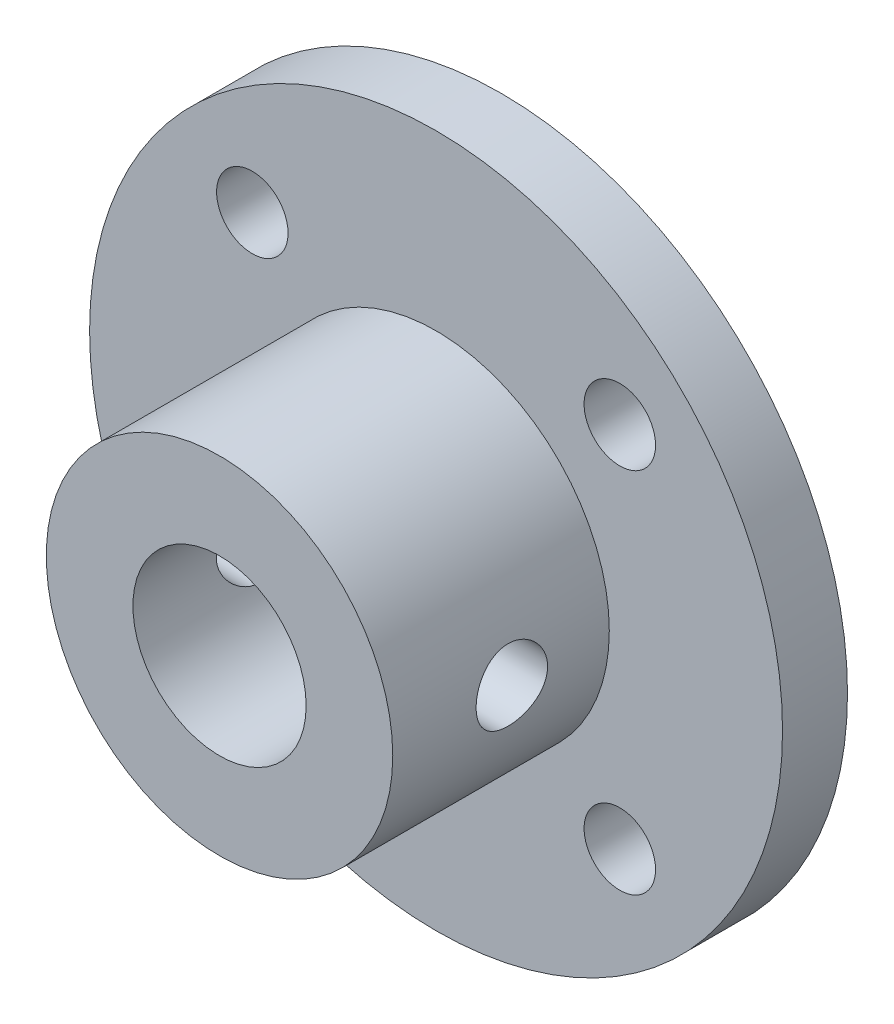
ISO-10303-21;
HEADER;
FILE_DESCRIPTION(('STEP AP214'),'2;1');
FILE_NAME('part.step','',(''),(''),'','','');
FILE_SCHEMA(('AUTOMOTIVE_DESIGN { 1 0 10303 214 1 1 1 1 }'));
ENDSEC;
DATA;
#1=APPLICATION_CONTEXT('core data for automotive mechanical design processes');
#2=APPLICATION_PROTOCOL_DEFINITION('international standard','automotive_design',2000,#1);
#3=PRODUCT_CONTEXT('',#1,'mechanical');
#4=PRODUCT('Part','Part','',(#3));
#5=PRODUCT_RELATED_PRODUCT_CATEGORY('part','',(#4));
#6=PRODUCT_DEFINITION_FORMATION('','',#4);
#7=PRODUCT_DEFINITION_CONTEXT('part definition',#1,'design');
#8=PRODUCT_DEFINITION('design','',#6,#7);
#9=PRODUCT_DEFINITION_SHAPE('','',#8);
#10=(LENGTH_UNIT() NAMED_UNIT(*) SI_UNIT(.MILLI.,.METRE.));
#11=(NAMED_UNIT(*) PLANE_ANGLE_UNIT() SI_UNIT($,.RADIAN.));
#12=(NAMED_UNIT(*) SI_UNIT($,.STERADIAN.) SOLID_ANGLE_UNIT());
#13=UNCERTAINTY_MEASURE_WITH_UNIT(LENGTH_MEASURE(1.E-05),#10,'distance_accuracy_value','');
#14=(GEOMETRIC_REPRESENTATION_CONTEXT(3) GLOBAL_UNCERTAINTY_ASSIGNED_CONTEXT((#13)) GLOBAL_UNIT_ASSIGNED_CONTEXT((#10,
#11,#12)) REPRESENTATION_CONTEXT('',''));
#15=CARTESIAN_POINT('',(0.,0.,0.));
#16=DIRECTION('',(0.,0.,1.));
#17=DIRECTION('',(1.,0.,0.));
#18=AXIS2_PLACEMENT_3D('',#15,#16,#17);
#19=CARTESIAN_POINT('',(0.,0.,3.));
#20=DIRECTION('',(0.,0.,-1.));
#21=DIRECTION('',(-1.,0.,0.));
#22=AXIS2_PLACEMENT_3D('',#19,#20,#21);
#23=CYLINDRICAL_SURFACE('',#22,16.);
#24=CARTESIAN_POINT('',(0.,0.,3.));
#25=DIRECTION('',(0.,0.,1.));
#26=DIRECTION('',(1.,0.,0.));
#27=AXIS2_PLACEMENT_3D('',#24,#25,#26);
#28=CIRCLE('',#27,16.);
#29=CARTESIAN_POINT('',(16.0000000000001,0.,3.));
#30=VERTEX_POINT('',#29);
#31=EDGE_CURVE('E47',#30,#30,#28,.T.);
#32=ORIENTED_EDGE('',*,*,#31,.F.);
#33=EDGE_LOOP('',(#32));
#34=FACE_BOUND('',#33,.T.);
#35=CARTESIAN_POINT('',(0.,0.,0.));
#36=DIRECTION('',(0.,0.,1.));
#37=DIRECTION('',(1.,0.,0.));
#38=AXIS2_PLACEMENT_3D('',#35,#36,#37);
#39=CIRCLE('',#38,16.);
#40=CARTESIAN_POINT('',(16.0000000000001,0.,0.));
#41=VERTEX_POINT('',#40);
#42=EDGE_CURVE('E55',#41,#41,#39,.T.);
#43=ORIENTED_EDGE('',*,*,#42,.T.);
#44=EDGE_LOOP('',(#43));
#45=FACE_BOUND('',#44,.T.);
#46=ADVANCED_FACE('F36',(#34,#45),#23,.T.);
#47=CARTESIAN_POINT('',(0.,0.,3.));
#48=DIRECTION('',(0.,0.,1.));
#49=DIRECTION('',(1.,0.,0.));
#50=AXIS2_PLACEMENT_3D('',#47,#48,#49);
#51=PLANE('',#50);
#52=CARTESIAN_POINT('',(-8.48528137423858,8.48528137423857,3.));
#53=DIRECTION('',(0.,0.,1.));
#54=DIRECTION('',(1.,0.,0.));
#55=AXIS2_PLACEMENT_3D('',#52,#53,#54);
#56=CIRCLE('',#55,1.65);
#57=CARTESIAN_POINT('',(-6.83528137423857,8.48528137423857,3.));
#58=VERTEX_POINT('',#57);
#59=EDGE_CURVE('E193',#58,#58,#56,.T.);
#60=ORIENTED_EDGE('',*,*,#59,.F.);
#61=EDGE_LOOP('',(#60));
#62=FACE_BOUND('',#61,.T.);
#63=CARTESIAN_POINT('',(8.48528137423857,8.48528137423857,3.));
#64=DIRECTION('',(0.,0.,1.));
#65=DIRECTION('',(1.,0.,0.));
#66=AXIS2_PLACEMENT_3D('',#63,#64,#65);
#67=CIRCLE('',#66,1.65);
#68=CARTESIAN_POINT('',(10.1352813742386,8.48528137423857,3.));
#69=VERTEX_POINT('',#68);
#70=EDGE_CURVE('E189',#69,#69,#67,.T.);
#71=ORIENTED_EDGE('',*,*,#70,.F.);
#72=EDGE_LOOP('',(#71));
#73=FACE_BOUND('',#72,.T.);
#74=CARTESIAN_POINT('',(8.4852813742386,-8.48528137423861,3.));
#75=DIRECTION('',(0.,0.,1.));
#76=DIRECTION('',(1.,0.,0.));
#77=AXIS2_PLACEMENT_3D('',#74,#75,#76);
#78=CIRCLE('',#77,1.65);
#79=CARTESIAN_POINT('',(10.1352813742386,-8.48528137423861,3.));
#80=VERTEX_POINT('',#79);
#81=EDGE_CURVE('E183',#80,#80,#78,.T.);
#82=ORIENTED_EDGE('',*,*,#81,.F.);
#83=EDGE_LOOP('',(#82));
#84=FACE_BOUND('',#83,.T.);
#85=CARTESIAN_POINT('',(-8.48528137423861,-8.4852813742386,3.));
#86=DIRECTION('',(0.,0.,1.));
#87=DIRECTION('',(1.,0.,0.));
#88=AXIS2_PLACEMENT_3D('',#85,#86,#87);
#89=CIRCLE('',#88,1.65);
#90=CARTESIAN_POINT('',(-6.83528137423861,-8.4852813742386,3.));
#91=VERTEX_POINT('',#90);
#92=EDGE_CURVE('E177',#91,#91,#89,.T.);
#93=ORIENTED_EDGE('',*,*,#92,.F.);
#94=EDGE_LOOP('',(#93));
#95=FACE_BOUND('',#94,.T.);
#96=CARTESIAN_POINT('',(0.,0.,3.));
#97=DIRECTION('',(0.,0.,1.));
#98=DIRECTION('',(1.,0.,0.));
#99=AXIS2_PLACEMENT_3D('',#96,#97,#98);
#100=CIRCLE('',#99,8.);
#101=CARTESIAN_POINT('',(8.00000000000002,0.,3.));
#102=VERTEX_POINT('',#101);
#103=EDGE_CURVE('E66',#102,#102,#100,.T.);
#104=ORIENTED_EDGE('',*,*,#103,.F.);
#105=EDGE_LOOP('',(#104));
#106=FACE_BOUND('',#105,.T.);
#107=ORIENTED_EDGE('',*,*,#31,.T.);
#108=EDGE_LOOP('',(#107));
#109=FACE_BOUND('',#108,.T.);
#110=ADVANCED_FACE('F116',(#62,#73,#84,#95,#106,#109),#51,.T.);
#111=CARTESIAN_POINT('',(0.,0.,0.));
#112=DIRECTION('',(0.,0.,1.));
#113=DIRECTION('',(1.,0.,0.));
#114=AXIS2_PLACEMENT_3D('',#111,#112,#113);
#115=PLANE('',#114);
#116=CARTESIAN_POINT('',(-8.48528137423859,8.48528137423857,0.));
#117=DIRECTION('',(0.,0.,1.));
#118=DIRECTION('',(1.,0.,0.));
#119=AXIS2_PLACEMENT_3D('',#116,#117,#118);
#120=CIRCLE('',#119,1.65);
#121=CARTESIAN_POINT('',(-6.83528137423859,8.48528137423857,0.));
#122=VERTEX_POINT('',#121);
#123=EDGE_CURVE('E132',#122,#122,#120,.T.);
#124=ORIENTED_EDGE('',*,*,#123,.T.);
#125=EDGE_LOOP('',(#124));
#126=FACE_BOUND('',#125,.T.);
#127=CARTESIAN_POINT('',(8.48528137423857,8.48528137423857,0.));
#128=DIRECTION('',(0.,0.,1.));
#129=DIRECTION('',(1.,0.,0.));
#130=AXIS2_PLACEMENT_3D('',#127,#128,#129);
#131=CIRCLE('',#130,1.65);
#132=CARTESIAN_POINT('',(10.1352813742386,8.48528137423857,0.));
#133=VERTEX_POINT('',#132);
#134=EDGE_CURVE('E136',#133,#133,#131,.T.);
#135=ORIENTED_EDGE('',*,*,#134,.T.);
#136=EDGE_LOOP('',(#135));
#137=FACE_BOUND('',#136,.T.);
#138=CARTESIAN_POINT('',(8.48528137423857,-8.48528137423857,0.));
#139=DIRECTION('',(0.,0.,1.));
#140=DIRECTION('',(1.,0.,0.));
#141=AXIS2_PLACEMENT_3D('',#138,#139,#140);
#142=CIRCLE('',#141,1.65);
#143=CARTESIAN_POINT('',(10.1352813742386,-8.48528137423857,0.));
#144=VERTEX_POINT('',#143);
#145=EDGE_CURVE('E140',#144,#144,#142,.T.);
#146=ORIENTED_EDGE('',*,*,#145,.T.);
#147=EDGE_LOOP('',(#146));
#148=FACE_BOUND('',#147,.T.);
#149=CARTESIAN_POINT('',(-8.48528137423861,-8.4852813742386,0.));
#150=DIRECTION('',(0.,0.,1.));
#151=DIRECTION('',(1.,0.,0.));
#152=AXIS2_PLACEMENT_3D('',#149,#150,#151);
#153=CIRCLE('',#152,1.65);
#154=CARTESIAN_POINT('',(-6.83528137423861,-8.4852813742386,0.));
#155=VERTEX_POINT('',#154);
#156=EDGE_CURVE('E144',#155,#155,#153,.T.);
#157=ORIENTED_EDGE('',*,*,#156,.T.);
#158=EDGE_LOOP('',(#157));
#159=FACE_BOUND('',#158,.T.);
#160=CARTESIAN_POINT('',(0.,0.,0.));
#161=DIRECTION('',(0.,0.,1.));
#162=DIRECTION('',(1.,0.,0.));
#163=AXIS2_PLACEMENT_3D('',#160,#161,#162);
#164=CIRCLE('',#163,4.);
#165=CARTESIAN_POINT('',(4.00000000000002,0.,0.));
#166=VERTEX_POINT('',#165);
#167=EDGE_CURVE('E147',#166,#166,#164,.T.);
#168=ORIENTED_EDGE('',*,*,#167,.T.);
#169=EDGE_LOOP('',(#168));
#170=FACE_BOUND('',#169,.T.);
#171=ORIENTED_EDGE('',*,*,#42,.F.);
#172=EDGE_LOOP('',(#171));
#173=FACE_BOUND('',#172,.T.);
#174=ADVANCED_FACE('F112',(#126,#137,#148,#159,#170,#173),#115,.F.);
#175=CARTESIAN_POINT('',(0.,0.,13.));
#176=DIRECTION('',(0.,0.,-1.));
#177=DIRECTION('',(-1.,0.,0.));
#178=AXIS2_PLACEMENT_3D('',#175,#176,#177);
#179=CYLINDRICAL_SURFACE('',#178,8.);
#180=CARTESIAN_POINT('',(8.00000000000001,0.,5.84999999999999));
#181=CARTESIAN_POINT('',(7.99999830466002,-0.0916407195421168,5.8500032970978));
#182=CARTESIAN_POINT('',(7.99840926134725,-0.183322508381988,5.85766035518842));
#183=CARTESIAN_POINT('',(7.99222359173557,-0.364090486799893,5.88805953567183));
#184=CARTESIAN_POINT('',(7.98762465402597,-0.453174626583013,5.91081325153871));
#185=CARTESIAN_POINT('',(7.97593225373361,-0.62610793776139,5.97066960772639));
#186=CARTESIAN_POINT('',(7.9688412517652,-0.709962177239571,6.00775809776895));
#187=CARTESIAN_POINT('',(7.95293377965833,-0.870252949930924,6.09518820033904));
#188=CARTESIAN_POINT('',(7.94411739325117,-0.946689842831834,6.14552916977705));
#189=CARTESIAN_POINT('',(7.9255864867241,-1.0910785006724,6.2588010629735));
#190=CARTESIAN_POINT('',(7.91586187136436,-1.15890845453259,6.32188562354079));
#191=CARTESIAN_POINT('',(7.89668321805648,-1.28310256116973,6.45852382878229));
#192=CARTESIAN_POINT('',(7.88722920223018,-1.3394657788141,6.53207832646761));
#193=CARTESIAN_POINT('',(7.86956329469159,-1.43965110093205,6.68845261124893));
#194=CARTESIAN_POINT('',(7.86136437560846,-1.48334592346544,6.77135554051843));
#195=CARTESIAN_POINT('',(7.84728086241898,-1.556138374432,6.94352376346135));
#196=CARTESIAN_POINT('',(7.84139602426695,-1.58523754222915,7.0327883850498));
#197=CARTESIAN_POINT('',(7.83270934672409,-1.6276148943817,7.21383194999833));
#198=CARTESIAN_POINT('',(7.82986577646946,-1.64110744112713,7.30555867318196));
#199=CARTESIAN_POINT('',(7.82745807970268,-1.65255460798122,7.49001455100844));
#200=CARTESIAN_POINT('',(7.82789359605782,-1.65051092017599,7.58274359538778));
#201=CARTESIAN_POINT('',(7.83195699249662,-1.63111668222383,7.76499542508165));
#202=CARTESIAN_POINT('',(7.8355333998161,-1.61401292403973,7.85454579230343));
#203=CARTESIAN_POINT('',(7.84539445259545,-1.56537407698978,8.02947813147744));
#204=CARTESIAN_POINT('',(7.85167923477146,-1.53383825960256,8.1148598927602));
#205=CARTESIAN_POINT('',(7.86630090751808,-1.4569977791722,8.27973690269176));
#206=CARTESIAN_POINT('',(7.8746521540866,-1.41159624906004,8.35918568076119));
#207=CARTESIAN_POINT('',(7.89245670014424,-1.3083813944234,8.50942921254005));
#208=CARTESIAN_POINT('',(7.90191013391075,-1.25056655688558,8.58022290966054));
#209=CARTESIAN_POINT('',(7.92107619190931,-1.12284972991962,8.71256973923748));
#210=CARTESIAN_POINT('',(7.93079031160688,-1.05273735419365,8.77391980874557));
#211=CARTESIAN_POINT('',(7.94921762583845,-0.903112309957831,8.88402151702536));
#212=CARTESIAN_POINT('',(7.95793080592347,-0.823599505782695,8.93277297394378));
#213=CARTESIAN_POINT('',(7.97339804723507,-0.657197902062817,9.01633520611295));
#214=CARTESIAN_POINT('',(7.98014868624195,-0.570296555511034,9.0511216693748));
#215=CARTESIAN_POINT('',(7.99090445204566,-0.391712622109074,9.10554403083056));
#216=CARTESIAN_POINT('',(7.99490993294788,-0.300030653566686,9.1251818831259));
#217=CARTESIAN_POINT('',(7.99967440549744,-0.116231946363161,9.14845954083965));
#218=CARTESIAN_POINT('',(8.00048974989201,-0.0241517979908812,9.15237707288142));
#219=CARTESIAN_POINT('',(7.998939058222,0.159347264679047,9.14485239834092));
#220=CARTESIAN_POINT('',(7.9965732128957,0.250766218290311,9.13341111264522));
#221=CARTESIAN_POINT('',(7.98896133117212,0.429444014904549,9.09572418712624));
#222=CARTESIAN_POINT('',(7.98374323165774,0.51673442647503,9.06962207793273));
#223=CARTESIAN_POINT('',(7.97101009225547,0.685699095825317,9.00351209172612));
#224=CARTESIAN_POINT('',(7.96349487230839,0.767372912734796,8.96350312459376));
#225=CARTESIAN_POINT('',(7.9468611414208,0.923949860452786,8.87012152443845));
#226=CARTESIAN_POINT('',(7.93772318016807,0.998751941729388,8.81658299644502));
#227=CARTESIAN_POINT('',(7.91890127310844,1.13840995014641,8.69788296043952));
#228=CARTESIAN_POINT('',(7.90921726486106,1.20326473664665,8.63272012133688));
#229=CARTESIAN_POINT('',(7.89020322125626,1.32226758953253,8.49135347486469));
#230=CARTESIAN_POINT('',(7.88088150077534,1.37622443804948,8.41498738366169));
#231=CARTESIAN_POINT('',(7.86382860657073,1.47054630126095,8.25411308003519));
#232=CARTESIAN_POINT('',(7.85609736723785,1.51091187665496,8.16960520368099));
#233=CARTESIAN_POINT('',(7.84316897738332,1.57664965148856,7.99528280762368));
#234=CARTESIAN_POINT('',(7.83795830360763,1.60210202195347,7.90549957210851));
#235=CARTESIAN_POINT('',(7.83063366117501,1.63753157889184,7.7228109665724));
#236=CARTESIAN_POINT('',(7.82851925954994,1.64751092905123,7.62990603493373));
#237=CARTESIAN_POINT('',(7.82765166523676,1.65162714556421,7.44553365991831));
#238=CARTESIAN_POINT('',(7.82883429816181,1.64606648188569,7.35407313863651));
#239=CARTESIAN_POINT('',(7.83428356728564,1.61993087801278,7.17342157552559));
#240=CARTESIAN_POINT('',(7.83855017513696,1.59935607582618,7.08423051284372));
#241=CARTESIAN_POINT('',(7.84965710898139,1.54391487276413,6.91085765152253));
#242=CARTESIAN_POINT('',(7.8564903451322,1.50908781763049,6.82666278697623));
#243=CARTESIAN_POINT('',(7.87196421207745,1.42616638770603,6.66526468478995));
#244=CARTESIAN_POINT('',(7.88060500656398,1.37807081119502,6.58806208127553));
#245=CARTESIAN_POINT('',(7.89891524219783,1.26895419649462,6.44133870150522));
#246=CARTESIAN_POINT('',(7.90860042776132,1.20771563989232,6.3719816260356));
#247=CARTESIAN_POINT('',(7.92779756602148,1.07449788612564,6.2444283458795));
#248=CARTESIAN_POINT('',(7.93730947834751,1.00251622096491,6.18623471279067));
#249=CARTESIAN_POINT('',(7.95521487654738,0.848880613767823,6.08203856905748));
#250=CARTESIAN_POINT('',(7.96359456503878,0.76712690091551,6.03618068748805));
#251=CARTESIAN_POINT('',(7.97815479541984,0.596921258332706,5.95892786004796));
#252=CARTESIAN_POINT('',(7.98433727409232,0.508475311474889,5.92752016948176));
#253=CARTESIAN_POINT('',(7.99263694073892,0.349887562280618,5.88598583861668));
#254=CARTESIAN_POINT('',(7.99538162684993,0.280634724618699,5.87251574674512));
#255=CARTESIAN_POINT('',(7.99906377620171,0.140929326188167,5.85452171892962));
#256=CARTESIAN_POINT('',(8.00000130381072,0.0704768082405113,5.84999746434847));
#257=CARTESIAN_POINT('',(8.00000000000001,0.,5.84999999999999));
#258=B_SPLINE_CURVE_WITH_KNOTS('',3,(#180,#181,#182,#183,#184,#185,#186,#187,#188,#189,#190,
#191,#192,#193,#194,#195,#196,#197,#198,#199,#200,#201,#202,#203,#204,#205,#206,#207,#208,#209,
#210,#211,#212,#213,#214,#215,#216,#217,#218,#219,#220,#221,#222,#223,#224,#225,#226,#227,#228,
#229,#230,#231,#232,#233,#234,#235,#236,#237,#238,#239,#240,#241,#242,#243,#244,#245,#246,#247,
#248,#249,#250,#251,#252,#253,#254,#255,#256,#257),.UNSPECIFIED.,.T.,.F.,(4,2,2,2,2,2,2,2,2,2,2,
2,2,2,2,2,2,2,2,2,2,2,2,2,2,2,2,2,2,2,2,2,2,2,2,2,2,2,4),(0.,0.274664286133516,
0.549539745146944,0.824144556648062,1.09873604513762,1.37686012616534,1.65500687961845,
1.93585838646541,2.2166802664369,2.4935973572463,2.77048428882735,3.04291655166272,
3.3153625682266,3.58975722869537,3.86418535314678,4.14387209364694,4.4235628710289,
4.70373847885488,4.98387793926427,5.25904586820427,5.53419729931632,5.80670078626848,
6.07922563881696,6.35526963287403,6.63134525682187,6.9119094352296,7.19246203771849,
7.4714922579036,7.75048345608685,8.02408241270294,8.2976788544684,8.57052502859192,
8.8433959223092,9.12118929442815,9.39904658206407,9.68003210657603,9.9607693317831,
10.1720089623927,10.3832410688303),.UNSPECIFIED.);
#259=CARTESIAN_POINT('',(8.00000000000001,0.,5.84999999999999));
#260=VERTEX_POINT('',#259);
#261=EDGE_CURVE('E10',#260,#260,#258,.T.);
#262=ORIENTED_EDGE('',*,*,#261,.T.);
#263=EDGE_LOOP('',(#262));
#264=FACE_BOUND('',#263,.T.);
#265=CARTESIAN_POINT('',(-8.,0.,9.14999999999999));
#266=CARTESIAN_POINT('',(-7.99999830466001,-0.0916407195421156,9.14999670290219));
#267=CARTESIAN_POINT('',(-7.99840926134724,-0.183322508381984,9.14233964481154));
#268=CARTESIAN_POINT('',(-7.99222359173558,-0.364090486799893,9.11194046432812));
#269=CARTESIAN_POINT('',(-7.987624654026,-0.45317462658302,9.08918674846127));
#270=CARTESIAN_POINT('',(-7.97593225373365,-0.62610793776139,9.02933039227361));
#271=CARTESIAN_POINT('',(-7.96884125176521,-0.709962177239556,8.99224190223103));
#272=CARTESIAN_POINT('',(-7.95293377965833,-0.870252949930892,8.90481179966093));
#273=CARTESIAN_POINT('',(-7.94411739325118,-0.946689842831799,8.85447083022293));
#274=CARTESIAN_POINT('',(-7.92558648672412,-1.09107850067236,8.74119893702649));
#275=CARTESIAN_POINT('',(-7.91586187136437,-1.15890845453256,8.6781143764592));
#276=CARTESIAN_POINT('',(-7.89668321805648,-1.2831025611697,8.5414761712177));
#277=CARTESIAN_POINT('',(-7.88722920223019,-1.33946577881408,8.46792167353237));
#278=CARTESIAN_POINT('',(-7.86956329469159,-1.43965110093203,8.31154738875106));
#279=CARTESIAN_POINT('',(-7.86136437560846,-1.48334592346542,8.22864445948156));
#280=CARTESIAN_POINT('',(-7.84728086241899,-1.55613837443199,8.05647623653866));
#281=CARTESIAN_POINT('',(-7.84139602426697,-1.58523754222915,7.96721161495021));
#282=CARTESIAN_POINT('',(-7.83270934672411,-1.62761489438171,7.78616805000169));
#283=CARTESIAN_POINT('',(-7.82986577646946,-1.64110744112713,7.69444132681805));
#284=CARTESIAN_POINT('',(-7.82745807970267,-1.65255460798121,7.50998544899157));
#285=CARTESIAN_POINT('',(-7.82789359605782,-1.65051092017597,7.41725640461224));
#286=CARTESIAN_POINT('',(-7.83195699249662,-1.63111668222382,7.23500457491836));
#287=CARTESIAN_POINT('',(-7.83553339981609,-1.61401292403973,7.14545420769657));
#288=CARTESIAN_POINT('',(-7.84539445259546,-1.5653740769898,6.97052186852255));
#289=CARTESIAN_POINT('',(-7.8516792347715,-1.53383825960257,6.88514010723978));
#290=CARTESIAN_POINT('',(-7.86630090751812,-1.4569977791722,6.72026309730822));
#291=CARTESIAN_POINT('',(-7.8746521540866,-1.41159624906005,6.64081431923879));
#292=CARTESIAN_POINT('',(-7.89245670014424,-1.30838139442342,6.49057078745993));
#293=CARTESIAN_POINT('',(-7.90191013391078,-1.25056655688559,6.41977709033945));
#294=CARTESIAN_POINT('',(-7.92107619190935,-1.12284972991964,6.28743026076251));
#295=CARTESIAN_POINT('',(-7.93079031160689,-1.05273735419366,6.22608019125439));
#296=CARTESIAN_POINT('',(-7.94921762583844,-0.90311230995784,6.11597848297461));
#297=CARTESIAN_POINT('',(-7.95793080592347,-0.823599505782693,6.06722702605621));
#298=CARTESIAN_POINT('',(-7.97339804723507,-0.657197902062814,5.98366479388703));
#299=CARTESIAN_POINT('',(-7.98014868624195,-0.570296555511042,5.94887833062515));
#300=CARTESIAN_POINT('',(-7.99090445204566,-0.391712622109082,5.89445596916941));
#301=CARTESIAN_POINT('',(-7.99490993294788,-0.300030653566683,5.87481811687412));
#302=CARTESIAN_POINT('',(-7.99967440549745,-0.116231946363141,5.85154045916035));
#303=CARTESIAN_POINT('',(-8.00048974989201,-0.0241517979908554,5.84762292711853));
#304=CARTESIAN_POINT('',(-7.998939058222,0.159347264679063,5.85514760165904));
#305=CARTESIAN_POINT('',(-7.99657321289572,0.250766218290311,5.86658888735481));
#306=CARTESIAN_POINT('',(-7.98896133117214,0.429444014904586,5.90427581287376));
#307=CARTESIAN_POINT('',(-7.98374323165773,0.516734426475119,5.93037792206718));
#308=CARTESIAN_POINT('',(-7.97101009225547,0.685699095825369,5.99648790827394));
#309=CARTESIAN_POINT('',(-7.9634948723084,0.76737291273476,6.03649687540653));
#310=CARTESIAN_POINT('',(-7.9468611414208,0.923949860452769,6.12987847556187));
#311=CARTESIAN_POINT('',(-7.93772318016806,0.998751941729485,6.18341700355509));
#312=CARTESIAN_POINT('',(-7.91890127310843,1.13840995014653,6.30211703956046));
#313=CARTESIAN_POINT('',(-7.90921726486108,1.20326473664668,6.36727987866316));
#314=CARTESIAN_POINT('',(-7.89020322125628,1.32226758953251,6.50864652513537));
#315=CARTESIAN_POINT('',(-7.88088150077533,1.37622443804951,6.58501261633832));
#316=CARTESIAN_POINT('',(-7.86382860657073,1.47054630126098,6.74588691996481));
#317=CARTESIAN_POINT('',(-7.85609736723788,1.51091187665495,6.83039479631904));
#318=CARTESIAN_POINT('',(-7.84316897738335,1.57664965148855,7.00471719237641));
#319=CARTESIAN_POINT('',(-7.83795830360762,1.6021020219535,7.0945004278916));
#320=CARTESIAN_POINT('',(-7.830633661175,1.63753157889189,7.2771890334278));
#321=CARTESIAN_POINT('',(-7.82851925954997,1.64751092905125,7.37009396506652));
#322=CARTESIAN_POINT('',(-7.8276516652368,1.65162714556417,7.55446634008198));
#323=CARTESIAN_POINT('',(-7.82883429816182,1.64606648188562,7.64592686136377));
#324=CARTESIAN_POINT('',(-7.83428356728564,1.61993087801275,7.8265784244747));
#325=CARTESIAN_POINT('',(-7.83855017513697,1.59935607582623,7.91576948715659));
#326=CARTESIAN_POINT('',(-7.84965710898141,1.54391487276412,8.08914234847774));
#327=CARTESIAN_POINT('',(-7.85649034513222,1.50908781763035,8.17333721302397));
#328=CARTESIAN_POINT('',(-7.87196421207748,1.4261663877059,8.33473531521029));
#329=CARTESIAN_POINT('',(-7.88060500656403,1.37807081119504,8.41193791872481));
#330=CARTESIAN_POINT('',(-7.89891524219788,1.26895419649462,8.55866129849506));
#331=CARTESIAN_POINT('',(-7.90860042776135,1.20771563989214,8.62801837396452));
#332=CARTESIAN_POINT('',(-7.92779756602151,1.07449788612546,8.75557165412064));
#333=CARTESIAN_POINT('',(-7.93730947834756,1.00251622096491,8.81376528720966));
#334=CARTESIAN_POINT('',(-7.95521487654741,0.848880613767887,8.91796143094282));
#335=CARTESIAN_POINT('',(-7.96359456503879,0.767126900915464,8.96381931251201));
#336=CARTESIAN_POINT('',(-7.97815479541985,0.596921258332613,9.04107213995195));
#337=CARTESIAN_POINT('',(-7.98433727409236,0.508475311474859,9.07247983051822));
#338=CARTESIAN_POINT('',(-7.99263694073895,0.349887562280625,9.11401416138331));
#339=CARTESIAN_POINT('',(-7.99538162684994,0.280634724618693,9.12748425325484));
#340=CARTESIAN_POINT('',(-7.99906377620171,0.140929326188154,9.14547828107034));
#341=CARTESIAN_POINT('',(-8.00000130381071,0.0704768082405035,9.15000253565151));
#342=CARTESIAN_POINT('',(-8.,0.,9.14999999999999));
#343=B_SPLINE_CURVE_WITH_KNOTS('',3,(#265,#266,#267,#268,#269,#270,#271,#272,#273,#274,#275,
#276,#277,#278,#279,#280,#281,#282,#283,#284,#285,#286,#287,#288,#289,#290,#291,#292,#293,#294,
#295,#296,#297,#298,#299,#300,#301,#302,#303,#304,#305,#306,#307,#308,#309,#310,#311,#312,#313,
#314,#315,#316,#317,#318,#319,#320,#321,#322,#323,#324,#325,#326,#327,#328,#329,#330,#331,#332,
#333,#334,#335,#336,#337,#338,#339,#340,#341,#342),.UNSPECIFIED.,.T.,.F.,(4,2,2,2,2,2,2,2,2,2,2,
2,2,2,2,2,2,2,2,2,2,2,2,2,2,2,2,2,2,2,2,2,2,2,2,2,2,2,4),(0.,0.274664286133511,
0.549539745146941,0.82414455664804,1.09873604513758,1.3768601261653,1.65500687961842,
1.93585838646537,2.21668026643685,2.49359735724625,2.7704842888273,3.04291655166269,
3.31536256822657,3.58975722869534,3.86418535314676,4.14387209364692,4.42356287102889,
4.70373847885486,4.98387793926426,5.25904586820428,5.53419729931633,5.80670078626852,
6.07922563881709,6.35526963287411,6.63134525682186,6.91190943522957,7.19246203771847,
7.47149225790371,7.75048345608709,8.02408241270318,8.29767885446863,8.57052502859214,
8.84339592230943,9.12118929442836,9.39904658206424,9.68003210657612,9.96076933178312,
10.1720089623927,10.3832410688303),.UNSPECIFIED.);
#344=CARTESIAN_POINT('',(-8.,0.,9.14999999999999));
#345=VERTEX_POINT('',#344);
#346=EDGE_CURVE('E68',#345,#345,#343,.T.);
#347=ORIENTED_EDGE('',*,*,#346,.T.);
#348=EDGE_LOOP('',(#347));
#349=FACE_BOUND('',#348,.T.);
#350=CARTESIAN_POINT('',(0.,0.,13.));
#351=DIRECTION('',(0.,0.,1.));
#352=DIRECTION('',(1.,0.,0.));
#353=AXIS2_PLACEMENT_3D('',#350,#351,#352);
#354=CIRCLE('',#353,8.);
#355=CARTESIAN_POINT('',(8.00000000000003,0.,13.));
#356=VERTEX_POINT('',#355);
#357=EDGE_CURVE('E63',#356,#356,#354,.T.);
#358=ORIENTED_EDGE('',*,*,#357,.F.);
#359=EDGE_LOOP('',(#358));
#360=FACE_BOUND('',#359,.T.);
#361=ORIENTED_EDGE('',*,*,#103,.T.);
#362=EDGE_LOOP('',(#361));
#363=FACE_BOUND('',#362,.T.);
#364=ADVANCED_FACE('F73',(#264,#349,#360,#363),#179,.T.);
#365=CARTESIAN_POINT('',(0.,0.,13.));
#366=DIRECTION('',(0.,0.,1.));
#367=DIRECTION('',(1.,0.,0.));
#368=AXIS2_PLACEMENT_3D('',#365,#366,#367);
#369=PLANE('',#368);
#370=CARTESIAN_POINT('',(0.,0.,13.));
#371=DIRECTION('',(0.,0.,1.));
#372=DIRECTION('',(1.,0.,0.));
#373=AXIS2_PLACEMENT_3D('',#370,#371,#372);
#374=CIRCLE('',#373,4.);
#375=CARTESIAN_POINT('',(4.00000000000002,0.,13.));
#376=VERTEX_POINT('',#375);
#377=EDGE_CURVE('E150',#376,#376,#374,.T.);
#378=ORIENTED_EDGE('',*,*,#377,.F.);
#379=EDGE_LOOP('',(#378));
#380=FACE_BOUND('',#379,.T.);
#381=ORIENTED_EDGE('',*,*,#357,.T.);
#382=EDGE_LOOP('',(#381));
#383=FACE_BOUND('',#382,.T.);
#384=ADVANCED_FACE('F103',(#380,#383),#369,.T.);
#385=CARTESIAN_POINT('',(0.,0.,0.));
#386=DIRECTION('',(0.,0.,1.));
#387=DIRECTION('',(1.,0.,0.));
#388=AXIS2_PLACEMENT_3D('',#385,#386,#387);
#389=CYLINDRICAL_SURFACE('',#388,4.);
#390=CARTESIAN_POINT('',(4.,0.,5.84999999999999));
#391=CARTESIAN_POINT('',(3.99999309817076,0.0884596783632776,5.85000921720662));
#392=CARTESIAN_POINT('',(3.99703145792173,0.177062252057582,5.8571560143433));
#393=CARTESIAN_POINT('',(3.9854711320255,0.351759669836408,5.88549114193689));
#394=CARTESIAN_POINT('',(3.97685757767606,0.437847271996959,5.90671651102431));
#395=CARTESIAN_POINT('',(3.95491965529936,0.604702496902741,5.96229481220189));
#396=CARTESIAN_POINT('',(3.94161112398211,0.685486934491198,5.99660364335344));
#397=CARTESIAN_POINT('',(3.91158286286531,0.840076633223484,6.07719475784942));
#398=CARTESIAN_POINT('',(3.89486420463245,0.913884076117555,6.12347328117016));
#399=CARTESIAN_POINT('',(3.85876900012149,1.05618769598524,6.22910675464405));
#400=CARTESIAN_POINT('',(3.83930654387258,1.12429373957476,6.28895767024897));
#401=CARTESIAN_POINT('',(3.80029483347099,1.24983574384757,6.41898883965896));
#402=CARTESIAN_POINT('',(3.78074553976623,1.30726618926956,6.48917439921181));
#403=CARTESIAN_POINT('',(3.74272551686067,1.41254826809048,6.64196824887172));
#404=CARTESIAN_POINT('',(3.72435159658093,1.4598078179056,6.72501111530653));
#405=CARTESIAN_POINT('',(3.69212136090386,1.53951358199406,6.89873630929018));
#406=CARTESIAN_POINT('',(3.67826276509115,1.57196727712791,6.98941475136301));
#407=CARTESIAN_POINT('',(3.65756021871623,1.61953738222491,7.17134799700183));
#408=CARTESIAN_POINT('',(3.65041449103237,1.63540371417152,7.26237107214306));
#409=CARTESIAN_POINT('',(3.64307714795704,1.65168918120801,7.44604650736527));
#410=CARTESIAN_POINT('',(3.64288180572738,1.65211659474,7.53869796762929));
#411=CARTESIAN_POINT('',(3.64921138579605,1.6380778077983,7.71559888661871));
#412=CARTESIAN_POINT('',(3.65523439741041,1.62472398487457,7.79995815874914));
#413=CARTESIAN_POINT('',(3.67247532251838,1.58536484231196,7.96511028438116));
#414=CARTESIAN_POINT('',(3.68369420783859,1.55935715587184,8.04590246760329));
#415=CARTESIAN_POINT('',(3.71031458481431,1.49492412942488,8.20364510875861));
#416=CARTESIAN_POINT('',(3.72579923184192,1.45624866973015,8.28047873780831));
#417=CARTESIAN_POINT('',(3.75918616236908,1.36775445443623,8.42686023246002));
#418=CARTESIAN_POINT('',(3.77708938726886,1.31793135478159,8.49640524224914));
#419=CARTESIAN_POINT('',(3.81509742396095,1.20371911924869,8.6322864077878));
#420=CARTESIAN_POINT('',(3.8352618825369,1.13846630094387,8.69788195770323));
#421=CARTESIAN_POINT('',(3.87426910607353,0.9976825548662,8.81744467444136));
#422=CARTESIAN_POINT('',(3.8931115728953,0.922149319847429,8.87140922386083));
#423=CARTESIAN_POINT('',(3.92787932271737,0.760736369737323,8.96723477358503));
#424=CARTESIAN_POINT('',(3.94373050716791,0.674664094072226,9.00880028319415));
#425=CARTESIAN_POINT('',(3.97016319816606,0.495928253552966,9.07660302410885));
#426=CARTESIAN_POINT('',(3.98074755693754,0.403268287372383,9.10284855321117));
#427=CARTESIAN_POINT('',(3.99492450637935,0.220181304317677,9.13772950367822));
#428=CARTESIAN_POINT('',(3.99891121146315,0.129974172308223,9.14735917793591));
#429=CARTESIAN_POINT('',(4.00069746426785,-0.0508474401522222,9.15169204376327));
#430=CARTESIAN_POINT('',(3.99849874371344,-0.141461799500566,9.1463994131082));
#431=CARTESIAN_POINT('',(3.98841747083847,-0.315907755487546,9.12175473175703));
#432=CARTESIAN_POINT('',(3.9808153168881,-0.39985531752668,9.10309592665988));
#433=CARTESIAN_POINT('',(3.96098887803091,-0.563340473329572,9.05320790366287));
#434=CARTESIAN_POINT('',(3.94876400644332,-0.642877505872147,9.02197709018519));
#435=CARTESIAN_POINT('',(3.92039728883464,-0.798061975964476,8.9468106200191));
#436=CARTESIAN_POINT('',(3.90414585630856,-0.873512656660504,8.90251143824377));
#437=CARTESIAN_POINT('',(3.86946768187548,-1.01617847320907,8.80286606574211));
#438=CARTESIAN_POINT('',(3.85104004134398,-1.0833901834211,8.74751530491014));
#439=CARTESIAN_POINT('',(3.8124029584454,-1.21261994292741,8.62279569518801));
#440=CARTESIAN_POINT('',(3.79215916493832,-1.27394364561821,8.55271617596069));
#441=CARTESIAN_POINT('',(3.75333928940831,-1.38414835482505,8.40292870939147));
#442=CARTESIAN_POINT('',(3.73476355904109,-1.43302674162726,8.32321874005745));
#443=CARTESIAN_POINT('',(3.70128700339843,-1.51742282291387,8.15490462946669));
#444=CARTESIAN_POINT('',(3.68643724424496,-1.55275802936534,8.06619808399195));
#445=CARTESIAN_POINT('',(3.66281640168181,-1.60769618165393,7.88329083402175));
#446=CARTESIAN_POINT('',(3.65404044124937,-1.62731175174753,7.78909460358182));
#447=CARTESIAN_POINT('',(3.6442955936524,-1.64901123940268,7.60556972684193));
#448=CARTESIAN_POINT('',(3.64278573581523,-1.65231049364125,7.51641278054205));
#449=CARTESIAN_POINT('',(3.64631178238903,-1.64451485356568,7.33887152924081));
#450=CARTESIAN_POINT('',(3.65134672892697,-1.6334220656173,7.25048711308062));
#451=CARTESIAN_POINT('',(3.666904904187,-1.59817118006572,7.0810669287423));
#452=CARTESIAN_POINT('',(3.6771726120025,-1.57461958437455,6.99987928857788));
#453=CARTESIAN_POINT('',(3.70184411206583,-1.51570599472929,6.84258547752591));
#454=CARTESIAN_POINT('',(3.7162490615217,-1.48034069596894,6.76648073570239));
#455=CARTESIAN_POINT('',(3.7486340889516,-1.39638062253791,6.61657796175861));
#456=CARTESIAN_POINT('',(3.76677577854002,-1.34712443599273,6.54318592897859));
#457=CARTESIAN_POINT('',(3.80412864636709,-1.23771718137824,6.40532831273571));
#458=CARTESIAN_POINT('',(3.82334018195057,-1.17756245772963,6.34086573722558));
#459=CARTESIAN_POINT('',(3.86230172013188,-1.04300738755744,6.21800586129632));
#460=CARTESIAN_POINT('',(3.88199359359226,-0.967900110730189,6.16036077639445));
#461=CARTESIAN_POINT('',(3.91832426905579,-0.808343463182038,6.05845984046127));
#462=CARTESIAN_POINT('',(3.93496167322678,-0.72388984344284,6.01421011363412));
#463=CARTESIAN_POINT('',(3.96305691394126,-0.549414760109611,5.94133626016527));
#464=CARTESIAN_POINT('',(3.97459855421813,-0.459513381649416,5.91245757464144));
#465=CARTESIAN_POINT('',(3.99154438775474,-0.27571922921323,5.87048891521483));
#466=CARTESIAN_POINT('',(3.99696786149571,-0.181839966818008,5.85734933375455));
#467=CARTESIAN_POINT('',(3.99968194626836,-0.0584442952271787,5.85077322966996));
#468=CARTESIAN_POINT('',(4.00000228058838,-0.0292299486703293,5.84999695433578));
#469=CARTESIAN_POINT('',(4.,0.,5.84999999999999));
#470=B_SPLINE_CURVE_WITH_KNOTS('',3,(#390,#391,#392,#393,#394,#395,#396,#397,#398,#399,#400,
#401,#402,#403,#404,#405,#406,#407,#408,#409,#410,#411,#412,#413,#414,#415,#416,#417,#418,#419,
#420,#421,#422,#423,#424,#425,#426,#427,#428,#429,#430,#431,#432,#433,#434,#435,#436,#437,#438,
#439,#440,#441,#442,#443,#444,#445,#446,#447,#448,#449,#450,#451,#452,#453,#454,#455,#456,#457,
#458,#459,#460,#461,#462,#463,#464,#465,#466,#467,#468,#469),.UNSPECIFIED.,.T.,.F.,(4,2,2,2,2,2,
2,2,2,2,2,2,2,2,2,2,2,2,2,2,2,2,2,2,2,2,2,2,2,2,2,2,2,2,2,2,2,2,2,4),(0.,0.265297098770618,
0.531294937906661,0.79640398149888,1.06142984766522,1.33841878994456,1.61555043582129,
1.90598404924538,2.19627075414925,2.4727764853942,2.74913395037958,3.00480633611682,
3.2605265616686,3.5216353930134,3.78284615202013,4.06565185095454,4.34852112528507,
4.63767392136374,4.92666995726765,5.19768149557683,5.46861716672802,5.72643264660551,
5.98428085748381,6.25011488704503,6.5160590741843,6.80064580250399,7.08529238632154,
7.37364985225777,7.66177550895673,7.92807823226721,8.19434198489782,8.44869772098555,
8.7031246710994,8.97267479984705,9.2423155088521,9.53104085816539,9.81989801073176,
10.1038095613048,10.3868238858899,10.4744866574818),.UNSPECIFIED.);
#471=CARTESIAN_POINT('',(4.,0.,5.84999999999999));
#472=VERTEX_POINT('',#471);
#473=EDGE_CURVE('E94',#472,#472,#470,.T.);
#474=ORIENTED_EDGE('',*,*,#473,.T.);
#475=EDGE_LOOP('',(#474));
#476=FACE_BOUND('',#475,.T.);
#477=CARTESIAN_POINT('',(-4.00000000000002,0.,5.85000000000002));
#478=CARTESIAN_POINT('',(-3.99999309817078,-0.0884596783632652,5.85000921720664));
#479=CARTESIAN_POINT('',(-3.99703145792173,-0.177062252057573,5.85715601434329));
#480=CARTESIAN_POINT('',(-3.9854711320255,-0.351759669836399,5.88549114193688));
#481=CARTESIAN_POINT('',(-3.97685757767607,-0.437847271996946,5.90671651102434));
#482=CARTESIAN_POINT('',(-3.95491965529936,-0.604702496902737,5.96229481220192));
#483=CARTESIAN_POINT('',(-3.9416111239821,-0.685486934491207,5.99660364335345));
#484=CARTESIAN_POINT('',(-3.91158286286531,-0.840076633223514,6.07719475784941));
#485=CARTESIAN_POINT('',(-3.89486420463247,-0.913884076117594,6.12347328117015));
#486=CARTESIAN_POINT('',(-3.85876900012152,-1.05618769598528,6.22910675464405));
#487=CARTESIAN_POINT('',(-3.83930654387258,-1.12429373957478,6.28895767024897));
#488=CARTESIAN_POINT('',(-3.80029483347097,-1.24983574384758,6.41898883965896));
#489=CARTESIAN_POINT('',(-3.78074553976623,-1.30726618926957,6.48917439921181));
#490=CARTESIAN_POINT('',(-3.74272551686067,-1.41254826809049,6.64196824887172));
#491=CARTESIAN_POINT('',(-3.72435159658091,-1.45980781790562,6.72501111530652));
#492=CARTESIAN_POINT('',(-3.69212136090386,-1.53951358199408,6.89873630929018));
#493=CARTESIAN_POINT('',(-3.67826276509118,-1.57196727712793,6.98941475136301));
#494=CARTESIAN_POINT('',(-3.65756021871626,-1.61953738222494,7.17134799700183));
#495=CARTESIAN_POINT('',(-3.65041449103236,-1.63540371417155,7.26237107214307));
#496=CARTESIAN_POINT('',(-3.64307714795702,-1.65168918120803,7.44604650736528));
#497=CARTESIAN_POINT('',(-3.64288180572739,-1.65211659474,7.53869796762931));
#498=CARTESIAN_POINT('',(-3.64921138579606,-1.6380778077983,7.71559888661873));
#499=CARTESIAN_POINT('',(-3.65523439741041,-1.62472398487458,7.79995815874916));
#500=CARTESIAN_POINT('',(-3.67247532251837,-1.58536484231198,7.96511028438117));
#501=CARTESIAN_POINT('',(-3.68369420783859,-1.55935715587185,8.0459024676033));
#502=CARTESIAN_POINT('',(-3.71031458481431,-1.49492412942488,8.20364510875862));
#503=CARTESIAN_POINT('',(-3.72579923184191,-1.45624866973016,8.28047873780833));
#504=CARTESIAN_POINT('',(-3.75918616236907,-1.36775445443624,8.42686023246004));
#505=CARTESIAN_POINT('',(-3.77708938726887,-1.31793135478159,8.49640524224917));
#506=CARTESIAN_POINT('',(-3.81509742396097,-1.20371911924869,8.63228640778782));
#507=CARTESIAN_POINT('',(-3.8352618825369,-1.13846630094387,8.69788195770325));
#508=CARTESIAN_POINT('',(-3.87426910607353,-0.9976825548662,8.81744467444137));
#509=CARTESIAN_POINT('',(-3.89311157289531,-0.92214931984743,8.87140922386084));
#510=CARTESIAN_POINT('',(-3.92787932271739,-0.760736369737325,8.96723477358503));
#511=CARTESIAN_POINT('',(-3.94373050716791,-0.674664094072228,9.00880028319416));
#512=CARTESIAN_POINT('',(-3.97016319816605,-0.495928253552966,9.07660302410886));
#513=CARTESIAN_POINT('',(-3.98074755693755,-0.403268287372381,9.10284855321117));
#514=CARTESIAN_POINT('',(-3.99492450637936,-0.220181304317674,9.13772950367822));
#515=CARTESIAN_POINT('',(-3.99891121146315,-0.129974172308222,9.14735917793591));
#516=CARTESIAN_POINT('',(-4.00069746426785,0.0508474401522214,9.15169204376327));
#517=CARTESIAN_POINT('',(-3.99849874371345,0.141461799500565,9.1463994131082));
#518=CARTESIAN_POINT('',(-3.98841747083848,0.315907755487542,9.12175473175703));
#519=CARTESIAN_POINT('',(-3.9808153168881,0.399855317526674,9.10309592665988));
#520=CARTESIAN_POINT('',(-3.96098887803091,0.563340473329568,9.05320790366286));
#521=CARTESIAN_POINT('',(-3.94876400644333,0.642877505872148,9.0219770901852));
#522=CARTESIAN_POINT('',(-3.92039728883465,0.798061975964471,8.9468106200191));
#523=CARTESIAN_POINT('',(-3.90414585630856,0.873512656660488,8.90251143824376));
#524=CARTESIAN_POINT('',(-3.86946768187549,1.01617847320905,8.80286606574211));
#525=CARTESIAN_POINT('',(-3.85104004134399,1.0833901834211,8.74751530491017));
#526=CARTESIAN_POINT('',(-3.81240295844541,1.21261994292741,8.62279569518804));
#527=CARTESIAN_POINT('',(-3.79215916493833,1.27394364561819,8.55271617596069));
#528=CARTESIAN_POINT('',(-3.75333928940831,1.38414835482503,8.40292870939146));
#529=CARTESIAN_POINT('',(-3.7347635590411,1.43302674162726,8.32321874005745));
#530=CARTESIAN_POINT('',(-3.70128700339844,1.51742282291387,8.15490462946669));
#531=CARTESIAN_POINT('',(-3.68643724424497,1.55275802936532,8.06619808399194));
#532=CARTESIAN_POINT('',(-3.66281640168182,1.60769618165391,7.88329083402175));
#533=CARTESIAN_POINT('',(-3.65404044124937,1.62731175174752,7.78909460358182));
#534=CARTESIAN_POINT('',(-3.6442955936524,1.64901123940267,7.60556972684193));
#535=CARTESIAN_POINT('',(-3.64278573581524,1.65231049364123,7.51641278054205));
#536=CARTESIAN_POINT('',(-3.64631178238904,1.64451485356566,7.33887152924081));
#537=CARTESIAN_POINT('',(-3.65134672892699,1.63342206561729,7.25048711308062));
#538=CARTESIAN_POINT('',(-3.66690490418702,1.59817118006571,7.08106692874229));
#539=CARTESIAN_POINT('',(-3.67717261200251,1.57461958437453,6.99987928857788));
#540=CARTESIAN_POINT('',(-3.70184411206584,1.51570599472926,6.84258547752591));
#541=CARTESIAN_POINT('',(-3.71624906152172,1.48034069596892,6.76648073570239));
#542=CARTESIAN_POINT('',(-3.74863408895162,1.39638062253789,6.61657796175861));
#543=CARTESIAN_POINT('',(-3.76677577854003,1.3471244359927,6.54318592897859));
#544=CARTESIAN_POINT('',(-3.80412864636709,1.23771718137822,6.40532831273571));
#545=CARTESIAN_POINT('',(-3.82334018195057,1.17756245772962,6.34086573722558));
#546=CARTESIAN_POINT('',(-3.86230172013189,1.04300738755743,6.21800586129632));
#547=CARTESIAN_POINT('',(-3.88199359359226,0.967900110730179,6.16036077639446));
#548=CARTESIAN_POINT('',(-3.91832426905579,0.808343463182036,6.05845984046128));
#549=CARTESIAN_POINT('',(-3.9349616732268,0.723889843442849,6.01421011363412));
#550=CARTESIAN_POINT('',(-3.96305691394127,0.549414760109629,5.94133626016527));
#551=CARTESIAN_POINT('',(-3.97459855421813,0.459513381649434,5.91245757464144));
#552=CARTESIAN_POINT('',(-3.99154438775475,0.275719229213252,5.87048891521485));
#553=CARTESIAN_POINT('',(-3.99696786149574,0.181839966818035,5.85734933375458));
#554=CARTESIAN_POINT('',(-3.99968194626839,0.0584442952272043,5.85077322966999));
#555=CARTESIAN_POINT('',(-4.00000228058841,0.0292299486703491,5.84999695433581));
#556=CARTESIAN_POINT('',(-4.00000000000002,0.,5.85000000000002));
#557=B_SPLINE_CURVE_WITH_KNOTS('',3,(#477,#478,#479,#480,#481,#482,#483,#484,#485,#486,#487,
#488,#489,#490,#491,#492,#493,#494,#495,#496,#497,#498,#499,#500,#501,#502,#503,#504,#505,#506,
#507,#508,#509,#510,#511,#512,#513,#514,#515,#516,#517,#518,#519,#520,#521,#522,#523,#524,#525,
#526,#527,#528,#529,#530,#531,#532,#533,#534,#535,#536,#537,#538,#539,#540,#541,#542,#543,#544,
#545,#546,#547,#548,#549,#550,#551,#552,#553,#554,#555,#556),.UNSPECIFIED.,.T.,.F.,(4,2,2,2,2,2,
2,2,2,2,2,2,2,2,2,2,2,2,2,2,2,2,2,2,2,2,2,2,2,2,2,2,2,2,2,2,2,2,2,4),(0.,0.26529709877062,
0.53129493790667,0.796403981498909,1.06142984766527,1.33841878994459,1.61555043582131,
1.9059840492454,2.19627075414927,2.47277648539424,2.74913395037963,3.00480633611686,
3.26052656166863,3.52163539301344,3.78284615202019,4.06565185095459,4.34852112528511,
4.63767392136378,4.9266699572677,5.19768149557687,5.46861716672806,5.72643264660555,
5.98428085748385,6.25011488704506,6.51605907418432,6.80064580250402,7.08529238632158,
7.37364985225781,7.66177550895676,7.92807823226724,8.19434198489785,8.44869772098559,
8.70312467109944,8.97267479984709,9.24231550885212,9.53104085816541,9.81989801073177,
10.1038095613048,10.3868238858898,10.4744866574818),.UNSPECIFIED.);
#558=CARTESIAN_POINT('',(-4.00000000000002,0.,5.85000000000002));
#559=VERTEX_POINT('',#558);
#560=EDGE_CURVE('E72',#559,#559,#557,.T.);
#561=ORIENTED_EDGE('',*,*,#560,.T.);
#562=EDGE_LOOP('',(#561));
#563=FACE_BOUND('',#562,.T.);
#564=ORIENTED_EDGE('',*,*,#167,.F.);
#565=EDGE_LOOP('',(#564));
#566=FACE_BOUND('',#565,.T.);
#567=ORIENTED_EDGE('',*,*,#377,.T.);
#568=EDGE_LOOP('',(#567));
#569=FACE_BOUND('',#568,.T.);
#570=ADVANCED_FACE('F98',(#476,#563,#566,#569),#389,.F.);
#571=CARTESIAN_POINT('',(-8.48528137423861,-8.4852813742386,3.));
#572=DIRECTION('',(0.,0.,1.));
#573=DIRECTION('',(1.,0.,0.));
#574=AXIS2_PLACEMENT_3D('',#571,#572,#573);
#575=CYLINDRICAL_SURFACE('',#574,1.65);
#576=ORIENTED_EDGE('',*,*,#156,.F.);
#577=EDGE_LOOP('',(#576));
#578=FACE_BOUND('',#577,.T.);
#579=ORIENTED_EDGE('',*,*,#92,.T.);
#580=EDGE_LOOP('',(#579));
#581=FACE_BOUND('',#580,.T.);
#582=ADVANCED_FACE('F102',(#578,#581),#575,.F.);
#583=CARTESIAN_POINT('',(8.4852813742386,-8.48528137423861,3.));
#584=DIRECTION('',(0.,0.,1.));
#585=DIRECTION('',(1.,0.,0.));
#586=AXIS2_PLACEMENT_3D('',#583,#584,#585);
#587=CYLINDRICAL_SURFACE('',#586,1.65);
#588=ORIENTED_EDGE('',*,*,#145,.F.);
#589=EDGE_LOOP('',(#588));
#590=FACE_BOUND('',#589,.T.);
#591=ORIENTED_EDGE('',*,*,#81,.T.);
#592=EDGE_LOOP('',(#591));
#593=FACE_BOUND('',#592,.T.);
#594=ADVANCED_FACE('F222',(#590,#593),#587,.F.);
#595=CARTESIAN_POINT('',(8.48528137423857,8.48528137423857,3.));
#596=DIRECTION('',(0.,0.,1.));
#597=DIRECTION('',(1.,0.,0.));
#598=AXIS2_PLACEMENT_3D('',#595,#596,#597);
#599=CYLINDRICAL_SURFACE('',#598,1.65);
#600=ORIENTED_EDGE('',*,*,#134,.F.);
#601=EDGE_LOOP('',(#600));
#602=FACE_BOUND('',#601,.T.);
#603=ORIENTED_EDGE('',*,*,#70,.T.);
#604=EDGE_LOOP('',(#603));
#605=FACE_BOUND('',#604,.T.);
#606=ADVANCED_FACE('F215',(#602,#605),#599,.F.);
#607=CARTESIAN_POINT('',(-8.48528137423858,8.48528137423857,3.));
#608=DIRECTION('',(0.,0.,1.));
#609=DIRECTION('',(1.,0.,0.));
#610=AXIS2_PLACEMENT_3D('',#607,#608,#609);
#611=CYLINDRICAL_SURFACE('',#610,1.65);
#612=ORIENTED_EDGE('',*,*,#123,.F.);
#613=EDGE_LOOP('',(#612));
#614=FACE_BOUND('',#613,.T.);
#615=ORIENTED_EDGE('',*,*,#59,.T.);
#616=EDGE_LOOP('',(#615));
#617=FACE_BOUND('',#616,.T.);
#618=ADVANCED_FACE('F83',(#614,#617),#611,.F.);
#619=CARTESIAN_POINT('',(8.00000000000002,0.,7.49999999999998));
#620=DIRECTION('',(1.,0.,0.));
#621=DIRECTION('',(0.,0.,-1.));
#622=AXIS2_PLACEMENT_3D('',#619,#620,#621);
#623=CYLINDRICAL_SURFACE('',#622,1.64999999999999);
#624=ORIENTED_EDGE('',*,*,#346,.F.);
#625=EDGE_LOOP('',(#624));
#626=FACE_BOUND('',#625,.T.);
#627=ORIENTED_EDGE('',*,*,#560,.F.);
#628=EDGE_LOOP('',(#627));
#629=FACE_BOUND('',#628,.T.);
#630=ADVANCED_FACE('F81',(#626,#629),#623,.F.);
#631=ORIENTED_EDGE('',*,*,#261,.F.);
#632=EDGE_LOOP('',(#631));
#633=FACE_BOUND('',#632,.T.);
#634=ORIENTED_EDGE('',*,*,#473,.F.);
#635=EDGE_LOOP('',(#634));
#636=FACE_BOUND('',#635,.T.);
#637=ADVANCED_FACE('F77',(#633,#636),#623,.F.);
#638=CLOSED_SHELL('',(#46,#110,#174,#364,#384,#570,#582,#594,#606,#618,#630,#637));
#639=MANIFOLD_SOLID_BREP('B2',#638);
#640=ADVANCED_BREP_SHAPE_REPRESENTATION('',(#18,#639),#14);
#641=SHAPE_DEFINITION_REPRESENTATION(#9,#640);
ENDSEC;
END-ISO-10303-21;
